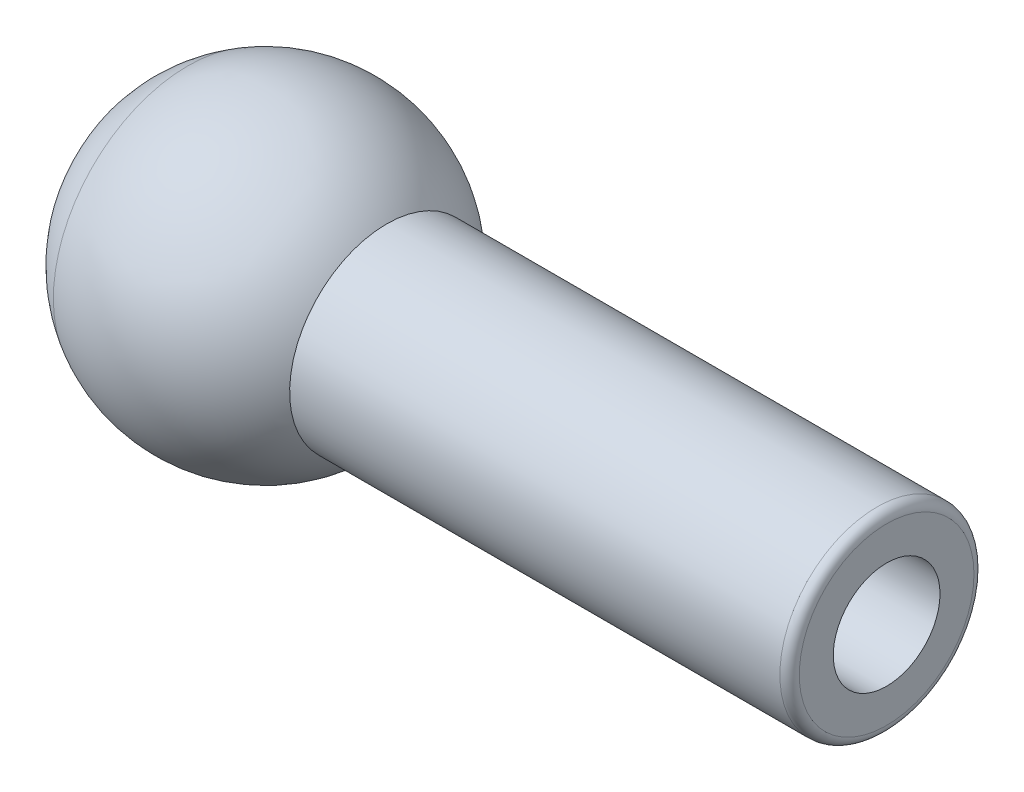
ISO-10303-21;
HEADER;
FILE_DESCRIPTION(('STEP AP214'),'2;1');
FILE_NAME('part.step','',(''),(''),'','','');
FILE_SCHEMA(('AUTOMOTIVE_DESIGN { 1 0 10303 214 1 1 1 1 }'));
ENDSEC;
DATA;
#1=APPLICATION_CONTEXT('core data for automotive mechanical design processes');
#2=APPLICATION_PROTOCOL_DEFINITION('international standard','automotive_design',2000,#1);
#3=PRODUCT_CONTEXT('',#1,'mechanical');
#4=PRODUCT('Part','Part','',(#3));
#5=PRODUCT_RELATED_PRODUCT_CATEGORY('part','',(#4));
#6=PRODUCT_DEFINITION_FORMATION('','',#4);
#7=PRODUCT_DEFINITION_CONTEXT('part definition',#1,'design');
#8=PRODUCT_DEFINITION('design','',#6,#7);
#9=PRODUCT_DEFINITION_SHAPE('','',#8);
#10=(LENGTH_UNIT() NAMED_UNIT(*) SI_UNIT(.MILLI.,.METRE.));
#11=(NAMED_UNIT(*) PLANE_ANGLE_UNIT() SI_UNIT($,.RADIAN.));
#12=(NAMED_UNIT(*) SI_UNIT($,.STERADIAN.) SOLID_ANGLE_UNIT());
#13=UNCERTAINTY_MEASURE_WITH_UNIT(LENGTH_MEASURE(1.E-05),#10,'distance_accuracy_value','');
#14=(GEOMETRIC_REPRESENTATION_CONTEXT(3) GLOBAL_UNCERTAINTY_ASSIGNED_CONTEXT((#13)) GLOBAL_UNIT_ASSIGNED_CONTEXT((#10,
#11,#12)) REPRESENTATION_CONTEXT('',''));
#15=CARTESIAN_POINT('',(0.,0.,0.));
#16=DIRECTION('',(0.,0.,1.));
#17=DIRECTION('',(1.,0.,0.));
#18=AXIS2_PLACEMENT_3D('',#15,#16,#17);
#19=CARTESIAN_POINT('',(-3.175,0.,0.));
#20=DIRECTION('',(1.,0.,0.));
#21=DIRECTION('',(0.,0.,-1.));
#22=AXIS2_PLACEMENT_3D('',#19,#20,#21);
#23=PLANE('',#22);
#24=CARTESIAN_POINT('',(-3.175,0.,0.));
#25=DIRECTION('',(1.,0.,0.));
#26=DIRECTION('',(0.,0.,-1.));
#27=AXIS2_PLACEMENT_3D('',#24,#25,#26);
#28=CIRCLE('',#27,3.96875);
#29=CARTESIAN_POINT('',(-3.175,0.,-3.96875));
#30=VERTEX_POINT('',#29);
#31=EDGE_CURVE('E378',#30,#30,#28,.T.);
#32=ORIENTED_EDGE('',*,*,#31,.F.);
#33=EDGE_LOOP('',(#32));
#34=FACE_BOUND('',#33,.T.);
#35=CARTESIAN_POINT('',(-3.175,0.,0.));
#36=DIRECTION('',(1.,0.,0.));
#37=DIRECTION('',(0.,0.,-1.));
#38=AXIS2_PLACEMENT_3D('',#35,#36,#37);
#39=CIRCLE('',#38,5.49926131403119);
#40=CARTESIAN_POINT('',(-3.175,5.49926131403119,0.));
#41=VERTEX_POINT('',#40);
#42=EDGE_CURVE('E374',#41,#41,#39,.F.);
#43=ORIENTED_EDGE('',*,*,#42,.F.);
#44=EDGE_LOOP('',(#43));
#45=FACE_BOUND('',#44,.T.);
#46=ADVANCED_FACE('F370',(#34,#45),#23,.T.);
#47=CARTESIAN_POINT('',(0.,0.,0.));
#48=DIRECTION('',(1.,0.,0.));
#49=DIRECTION('',(0.,0.,-1.));
#50=AXIS2_PLACEMENT_3D('',#47,#48,#49);
#51=CYLINDRICAL_SURFACE('',#50,3.96875);
#52=CARTESIAN_POINT('',(-4.95696716122873,0.,0.));
#53=DIRECTION('',(1.,0.,0.));
#54=DIRECTION('',(0.,0.,-1.));
#55=AXIS2_PLACEMENT_3D('',#52,#53,#54);
#56=CIRCLE('',#55,3.96875);
#57=CARTESIAN_POINT('',(-4.95696716122873,3.96875,0.));
#58=VERTEX_POINT('',#57);
#59=EDGE_CURVE('E12',#58,#58,#56,.T.);
#60=ORIENTED_EDGE('',*,*,#59,.F.);
#61=EDGE_LOOP('',(#60));
#62=FACE_BOUND('',#61,.T.);
#63=ORIENTED_EDGE('',*,*,#31,.T.);
#64=EDGE_LOOP('',(#63));
#65=FACE_BOUND('',#64,.T.);
#66=ADVANCED_FACE('F372',(#62,#65),#51,.F.);
#67=CARTESIAN_POINT('',(0.,0.,0.));
#68=DIRECTION('',(1.,0.,0.));
#69=DIRECTION('',(0.,1.,0.));
#70=AXIS2_PLACEMENT_3D('',#67,#68,#69);
#71=SPHERICAL_SURFACE('',#70,6.35);
#72=CARTESIAN_POINT('',(-4.95696716122873,3.96875,0.));
#73=CARTESIAN_POINT('',(-4.94158553108122,3.9879616610096,0.));
#74=CARTESIAN_POINT('',(-4.92609220280035,4.00708389176063,0.));
#75=CARTESIAN_POINT('',(-4.89488426806199,4.04514692701055,0.));
#76=CARTESIAN_POINT('',(-4.8791696616045,4.06408773150945,0.));
#77=CARTESIAN_POINT('',(-4.84752128860298,4.10178534852015,0.));
#78=CARTESIAN_POINT('',(-4.83158752205895,4.12054216103195,0.));
#79=CARTESIAN_POINT('',(-4.79950298461745,4.15786925977867,0.));
#80=CARTESIAN_POINT('',(-4.78335221372,4.1764395460136,0.));
#81=CARTESIAN_POINT('',(-4.75083585049322,4.21339108137181,0.));
#82=CARTESIAN_POINT('',(-4.73447025816391,4.2317723304951,0.));
#83=CARTESIAN_POINT('',(-4.70152646461155,4.26834330682248,0.));
#84=CARTESIAN_POINT('',(-4.68494826338851,4.28653303402658,0.));
#85=CARTESIAN_POINT('',(-4.65158149317462,4.3227185074729,0.));
#86=CARTESIAN_POINT('',(-4.63479292418377,4.34071425371512,0.));
#87=CARTESIAN_POINT('',(-4.60100768804047,4.37650933245259,0.));
#88=CARTESIAN_POINT('',(-4.58401102088802,4.39430866494783,0.));
#89=CARTESIAN_POINT('',(-4.54981188614888,4.42970850994978,0.));
#90=CARTESIAN_POINT('',(-4.53260941856219,4.44730902245647,0.));
#91=CARTESIAN_POINT('',(-4.49800100850641,4.48230884812007,0.));
#92=CARTESIAN_POINT('',(-4.48059506603732,4.49970816127697,0.));
#93=CARTESIAN_POINT('',(-4.44558205927501,4.53430323607863,0.));
#94=CARTESIAN_POINT('',(-4.42797499498177,4.55149899772339,0.));
#95=CARTESIAN_POINT('',(-4.39256212481869,4.58568464485611,0.));
#96=CARTESIAN_POINT('',(-4.37475631894883,4.60267453034407,0.));
#97=CARTESIAN_POINT('',(-4.33894837274726,4.63644612835032,0.));
#98=CARTESIAN_POINT('',(-4.32094623241554,4.65322784086861,0.));
#99=CARTESIAN_POINT('',(-4.2847480509469,4.68658082426491,0.));
#100=CARTESIAN_POINT('',(-4.26655200980997,4.70315209514292,0.));
#101=CARTESIAN_POINT('',(-4.22996848660045,4.73608195503708,0.));
#102=CARTESIAN_POINT('',(-4.21158100452786,4.75244054405322,0.));
#103=CARTESIAN_POINT('',(-4.17461708519687,4.78494282875388,0.));
#104=CARTESIAN_POINT('',(-4.15604064793847,4.80108652443839,0.));
#105=CARTESIAN_POINT('',(-4.11870132953006,4.83315684005682,0.));
#106=CARTESIAN_POINT('',(-4.09993844838005,4.84908345999074,0.));
#107=CARTESIAN_POINT('',(-4.06222877868737,4.88071747103486,0.));
#108=CARTESIAN_POINT('',(-4.0432819901447,4.89642486214506,0.));
#109=CARTESIAN_POINT('',(-4.00520706702761,4.92761829210551,0.));
#110=CARTESIAN_POINT('',(-3.98607893245318,4.94310433095577,0.));
#111=CARTESIAN_POINT('',(-3.94764390314907,4.97385296288408,0.));
#112=CARTESIAN_POINT('',(-3.92833700841939,4.98911555596214,0.));
#113=CARTESIAN_POINT('',(-3.88954706884736,5.01941523304076,0.));
#114=CARTESIAN_POINT('',(-3.87006402400501,5.03445231704133,0.));
#115=CARTESIAN_POINT('',(-3.83092441806346,5.06429894314564,0.));
#116=CARTESIAN_POINT('',(-3.81126785696424,5.07910848524937,0.));
#117=CARTESIAN_POINT('',(-3.77178387582188,5.1084980255013,0.));
#118=CARTESIAN_POINT('',(-3.75195645577873,5.1230780236495,0.));
#119=CARTESIAN_POINT('',(-3.71213343715948,5.15200650496328,0.));
#120=CARTESIAN_POINT('',(-3.69213783858337,5.16635498812886,0.));
#121=CARTESIAN_POINT('',(-3.65198116604424,5.19481849974728,0.));
#122=CARTESIAN_POINT('',(-3.6318200920812,5.20893352820012,0.));
#123=CARTESIAN_POINT('',(-3.59133519428632,5.23692822222627,0.));
#124=CARTESIAN_POINT('',(-3.57101137045447,5.25080788779958,0.));
#125=CARTESIAN_POINT('',(-3.53020372043444,5.27832997970561,0.));
#126=CARTESIAN_POINT('',(-3.50971989424626,5.29197240603833,0.));
#127=CARTESIAN_POINT('',(-3.46859500868357,5.31901817521974,0.));
#128=CARTESIAN_POINT('',(-3.44795394930906,5.33242151806843,0.));
#129=CARTESIAN_POINT('',(-3.40651738769789,5.35898730818783,0.));
#130=CARTESIAN_POINT('',(-3.38572188546122,5.37214975545854,0.));
#131=CARTESIAN_POINT('',(-3.34397924970817,5.3982319755341,0.));
#132=CARTESIAN_POINT('',(-3.32303211619177,5.41115174833895,0.));
#133=CARTESIAN_POINT('',(-3.28098904854373,5.43674687101243,0.));
#134=CARTESIAN_POINT('',(-3.25989311441208,5.44942222088107,0.));
#135=CARTESIAN_POINT('',(-3.2175553016005,5.47452679117021,0.));
#136=CARTESIAN_POINT('',(-3.19631342292057,5.48695601159071,0.));
#137=CARTESIAN_POINT('',(-3.175,5.49926131403119,0.));
#138=B_SPLINE_CURVE_WITH_KNOTS('',3,(#72,#73,#74,#75,#76,#77,#78,#79,#80,#81,#82,#83,#84,#85,
#86,#87,#88,#89,#90,#91,#92,#93,#94,#95,#96,#97,#98,#99,#100,#101,#102,#103,#104,#105,#106,#107,
#108,#109,#110,#111,#112,#113,#114,#115,#116,#117,#118,#119,#120,#121,#122,#123,#124,#125,#126,
#127,#128,#129,#130,#131,#132,#133,#134,#135,#136,#137),.UNSPECIFIED.,.F.,.F.,(4,2,2,2,2,2,2,2,
2,2,2,2,2,2,2,2,2,2,2,2,2,2,2,2,2,2,2,2,2,2,2,2,4),(0.,0.0738314346147441,0.147662869229488,
0.221494303844233,0.295325738458978,0.369157173073723,0.442988607688467,0.516820042303212,
0.590651476917956,0.664482911532701,0.738314346147445,0.812145780762189,0.885977215376934,
0.959808649991679,1.03364008460642,1.10747151922117,1.18130295383591,1.25513438845066,
1.3289658230654,1.40279725768015,1.47662869229489,1.55046012690963,1.62429156152438,
1.69812299613912,1.77195443075387,1.84578586536861,1.91961729998336,1.9934487345981,
2.06728016921285,2.14111160382759,2.21494303844233,2.28877447305708,2.36260590767182),.UNSPECIFIED.);
#139=EDGE_CURVE('BSEAM388',#58,#41,#138,.T.);
#140=ORIENTED_EDGE('',*,*,#59,.T.);
#141=ORIENTED_EDGE('',*,*,#42,.T.);
#142=ORIENTED_EDGE('',*,*,#139,.T.);
#143=ORIENTED_EDGE('',*,*,#139,.F.);
#144=EDGE_LOOP('',(#140,#142,#141,#143));
#145=FACE_BOUND('',#144,.T.);
#146=ADVANCED_FACE('F388',(#145),#71,.T.);
#147=CLOSED_SHELL('',(#46,#66,#146));
#148=MANIFOLD_SOLID_BREP('B2',#147);
#149=CARTESIAN_POINT('',(-3.175,0.,0.));
#150=DIRECTION('',(1.,0.,0.));
#151=DIRECTION('',(0.,0.,-1.));
#152=AXIS2_PLACEMENT_3D('',#149,#150,#151);
#153=PLANE('',#152);
#154=CARTESIAN_POINT('',(-3.175,0.,0.));
#155=DIRECTION('',(1.,0.,0.));
#156=DIRECTION('',(0.,0.,-1.));
#157=AXIS2_PLACEMENT_3D('',#154,#155,#156);
#158=CIRCLE('',#157,5.49926131403119);
#159=CARTESIAN_POINT('',(-3.175,5.49926131403119,0.));
#160=VERTEX_POINT('',#159);
#161=EDGE_CURVE('E417',#160,#160,#158,.F.);
#162=ORIENTED_EDGE('',*,*,#161,.T.);
#163=EDGE_LOOP('',(#162));
#164=FACE_BOUND('',#163,.T.);
#165=CARTESIAN_POINT('',(-3.175,0.,0.));
#166=DIRECTION('',(1.,0.,0.));
#167=DIRECTION('',(0.,0.,-1.));
#168=AXIS2_PLACEMENT_3D('',#165,#166,#167);
#169=CIRCLE('',#168,3.96875);
#170=CARTESIAN_POINT('',(-3.175,0.,-3.96875));
#171=VERTEX_POINT('',#170);
#172=EDGE_CURVE('E369',#171,#171,#169,.T.);
#173=ORIENTED_EDGE('',*,*,#172,.T.);
#174=EDGE_LOOP('',(#173));
#175=FACE_BOUND('',#174,.T.);
#176=ADVANCED_FACE('F410',(#164,#175),#153,.F.);
#177=CARTESIAN_POINT('',(0.,0.,0.));
#178=DIRECTION('',(1.,0.,0.));
#179=DIRECTION('',(0.,0.,-1.));
#180=AXIS2_PLACEMENT_3D('',#177,#178,#179);
#181=CYLINDRICAL_SURFACE('',#180,2.1828125);
#182=CARTESIAN_POINT('',(25.4,0.,0.));
#183=DIRECTION('',(1.,0.,0.));
#184=DIRECTION('',(0.,0.,-1.));
#185=AXIS2_PLACEMENT_3D('',#182,#183,#184);
#186=CIRCLE('',#185,2.1828125);
#187=CARTESIAN_POINT('',(25.4,0.,-2.1828125));
#188=VERTEX_POINT('',#187);
#189=EDGE_CURVE('E437',#188,#188,#186,.T.);
#190=ORIENTED_EDGE('',*,*,#189,.T.);
#191=EDGE_LOOP('',(#190));
#192=FACE_BOUND('',#191,.T.);
#193=CARTESIAN_POINT('',(0.254000000000001,0.,0.));
#194=DIRECTION('',(1.,0.,0.));
#195=DIRECTION('',(0.,0.,-1.));
#196=AXIS2_PLACEMENT_3D('',#193,#194,#195);
#197=CIRCLE('',#196,2.1828125);
#198=CARTESIAN_POINT('',(0.254000000000001,0.,-2.1828125));
#199=VERTEX_POINT('',#198);
#200=EDGE_CURVE('E428',#199,#199,#197,.T.);
#201=ORIENTED_EDGE('',*,*,#200,.F.);
#202=EDGE_LOOP('',(#201));
#203=FACE_BOUND('',#202,.T.);
#204=ADVANCED_FACE('F412',(#192,#203),#181,.F.);
#205=CARTESIAN_POINT('',(25.4,3.96875,0.));
#206=DIRECTION('',(1.,0.,0.));
#207=DIRECTION('',(0.,0.,-1.));
#208=AXIS2_PLACEMENT_3D('',#205,#206,#207);
#209=PLANE('',#208);
#210=CARTESIAN_POINT('',(25.4,0.,0.));
#211=DIRECTION('',(1.,0.,0.));
#212=DIRECTION('',(0.,0.,-1.));
#213=AXIS2_PLACEMENT_3D('',#210,#211,#212);
#214=CIRCLE('',#213,3.571875);
#215=CARTESIAN_POINT('',(25.4,0.,-3.571875));
#216=VERTEX_POINT('',#215);
#217=EDGE_CURVE('E426',#216,#216,#214,.T.);
#218=ORIENTED_EDGE('',*,*,#217,.T.);
#219=EDGE_LOOP('',(#218));
#220=FACE_BOUND('',#219,.T.);
#221=ORIENTED_EDGE('',*,*,#189,.F.);
#222=EDGE_LOOP('',(#221));
#223=FACE_BOUND('',#222,.T.);
#224=ADVANCED_FACE('F443',(#220,#223),#209,.T.);
#225=CARTESIAN_POINT('',(0.,0.,0.));
#226=DIRECTION('',(1.,0.,0.));
#227=DIRECTION('',(0.,0.,-1.));
#228=AXIS2_PLACEMENT_3D('',#225,#226,#227);
#229=CYLINDRICAL_SURFACE('',#228,3.96875);
#230=CARTESIAN_POINT('',(25.003125,0.,0.));
#231=DIRECTION('',(1.,0.,0.));
#232=DIRECTION('',(0.,0.,-1.));
#233=AXIS2_PLACEMENT_3D('',#230,#231,#232);
#234=CIRCLE('',#233,3.96875);
#235=CARTESIAN_POINT('',(25.003125,0.,-3.96875));
#236=VERTEX_POINT('',#235);
#237=EDGE_CURVE('E421',#236,#236,#234,.F.);
#238=ORIENTED_EDGE('',*,*,#237,.T.);
#239=EDGE_LOOP('',(#238));
#240=FACE_BOUND('',#239,.T.);
#241=CARTESIAN_POINT('',(4.95696716122873,0.,0.));
#242=DIRECTION('',(1.,0.,0.));
#243=DIRECTION('',(0.,0.,-1.));
#244=AXIS2_PLACEMENT_3D('',#241,#242,#243);
#245=CIRCLE('',#244,3.96875);
#246=CARTESIAN_POINT('',(4.95696716122873,3.96875,0.));
#247=VERTEX_POINT('',#246);
#248=EDGE_CURVE('E434',#247,#247,#245,.T.);
#249=ORIENTED_EDGE('',*,*,#248,.T.);
#250=EDGE_LOOP('',(#249));
#251=FACE_BOUND('',#250,.T.);
#252=ADVANCED_FACE('F470',(#240,#251),#229,.T.);
#253=CARTESIAN_POINT('',(0.,0.,0.));
#254=DIRECTION('',(1.,0.,0.));
#255=DIRECTION('',(0.,1.,0.));
#256=AXIS2_PLACEMENT_3D('',#253,#254,#255);
#257=SPHERICAL_SURFACE('',#256,6.35);
#258=CARTESIAN_POINT('',(-3.175,5.49926131403119,0.));
#259=CARTESIAN_POINT('',(-3.09369962527934,5.54620180375616,0.));
#260=CARTESIAN_POINT('',(-3.01135698228311,5.59133680599584,0.));
#261=CARTESIAN_POINT('',(-2.84475208689356,5.67791279501606,0.));
#262=CARTESIAN_POINT('',(-2.76048983450026,5.71935378179659,0.));
#263=CARTESIAN_POINT('',(-2.59021064747066,5.79845869940991,0.));
#264=CARTESIAN_POINT('',(-2.50419371283437,5.83612263024271,0.));
#265=CARTESIAN_POINT('',(-2.33057455116699,5.9075997708278,0.));
#266=CARTESIAN_POINT('',(-2.2429723241359,5.9414129805801,0.));
#267=CARTESIAN_POINT('',(-2.06635481437803,6.0051220657531,0.));
#268=CARTESIAN_POINT('',(-1.97733953165124,6.03501794117379,0.));
#269=CARTESIAN_POINT('',(-1.79807099899702,6.09083358872176,0.));
#270=CARTESIAN_POINT('',(-1.70781774906959,6.11675336084902,0.));
#271=CARTESIAN_POINT('',(-1.52625078585207,6.16456581550291,0.));
#272=CARTESIAN_POINT('',(-1.434937072562,6.18645849802954,0.));
#273=CARTESIAN_POINT('',(-1.25142877736611,6.22617371759419,0.));
#274=CARTESIAN_POINT('',(-1.15923419546029,6.24399625463222,0.));
#275=CARTESIAN_POINT('',(-0.974145488854031,6.27553612970845,0.));
#276=CARTESIAN_POINT('',(-0.88125136415359,6.28925346774665,0.));
#277=CARTESIAN_POINT('',(-0.694946273997775,6.31255596604047,0.));
#278=CARTESIAN_POINT('',(-0.6015353085424,6.32214112629608,0.));
#279=CARTESIAN_POINT('',(-0.414380255326221,6.33716041711814,0.));
#280=CARTESIAN_POINT('',(-0.320636167565416,6.34259454768458,0.));
#281=CARTESIAN_POINT('',(-0.132999243391807,6.34930109142015,0.));
#282=CARTESIAN_POINT('',(-0.039106406979003,6.35057350458928,0.));
#283=CARTESIAN_POINT('',(0.148643348297054,6.34895411097527,0.));
#284=CARTESIAN_POINT('',(0.242500267160308,6.34606230419213,0.));
#285=CARTESIAN_POINT('',(0.429993591775572,6.33612015821132,0.));
#286=CARTESIAN_POINT('',(0.523629997527581,6.32906981901366,0.));
#287=CARTESIAN_POINT('',(0.710498134059134,6.31082447464348,0.));
#288=CARTESIAN_POINT('',(0.803729864838677,6.29962946947096,0.));
#289=CARTESIAN_POINT('',(0.989605285469073,6.27311681122169,0.));
#290=CARTESIAN_POINT('',(1.08224897531993,6.25779915814494,0.));
#291=CARTESIAN_POINT('',(1.2667661046817,6.22307133048385,0.));
#292=CARTESIAN_POINT('',(1.35863954419262,6.20366115589952,0.));
#293=CARTESIAN_POINT('',(1.54143547837337,6.16078646069415,0.));
#294=CARTESIAN_POINT('',(1.63235797304322,6.13732194007312,0.));
#295=CARTESIAN_POINT('',(1.81307319333637,6.08638470225678,0.));
#296=CARTESIAN_POINT('',(1.90286591895968,6.05891198506148,0.));
#297=CARTESIAN_POINT('',(2.08114499895752,6.00001238678515,0.));
#298=CARTESIAN_POINT('',(2.16963135333204,5.96858550570412,0.));
#299=CARTESIAN_POINT('',(2.34512365796916,5.90183938929988,0.));
#300=CARTESIAN_POINT('',(2.43212960823176,5.86652015397666,0.));
#301=CARTESIAN_POINT('',(2.60448998340874,5.79205879412431,0.));
#302=CARTESIAN_POINT('',(2.68984440832312,5.75291666959517,0.));
#303=CARTESIAN_POINT('',(2.85873385973648,5.67088651512474,0.));
#304=CARTESIAN_POINT('',(2.94226888623546,5.62799848518345,0.));
#305=CARTESIAN_POINT('',(3.10735524614435,5.53856087107879,0.));
#306=CARTESIAN_POINT('',(3.18890657955425,5.49201128691543,0.));
#307=CARTESIAN_POINT('',(3.34986515992815,5.3953421168713,0.));
#308=CARTESIAN_POINT('',(3.42927240689214,5.34522253099054,0.));
#309=CARTESIAN_POINT('',(3.58578663856647,5.24151193194605,0.));
#310=CARTESIAN_POINT('',(3.66289362327681,5.18792091878233,0.));
#311=CARTESIAN_POINT('',(3.81465567645809,5.07737286513025,0.));
#312=CARTESIAN_POINT('',(3.88931074492903,5.0204158246419,0.));
#313=CARTESIAN_POINT('',(4.03602214252255,4.9032477439742,0.));
#314=CARTESIAN_POINT('',(4.10807847164511,4.84303670379484,0.));
#315=CARTESIAN_POINT('',(4.24945064682681,4.71947902345465,0.));
#316=CARTESIAN_POINT('',(4.31876649288595,4.65613238329383,0.));
#317=CARTESIAN_POINT('',(4.45452146661656,4.52642817352518,0.));
#318=CARTESIAN_POINT('',(4.52096059428802,4.46007060391737,0.));
#319=CARTESIAN_POINT('',(4.65083111163056,4.32447474022215,0.));
#320=CARTESIAN_POINT('',(4.71426250130164,4.25523644613475,0.));
#321=CARTESIAN_POINT('',(4.83799408870445,4.11401644995372,0.));
#322=CARTESIAN_POINT('',(4.89829428643617,4.04203474786009,0.));
#323=CARTESIAN_POINT('',(4.95696716122873,3.96875,0.));
#324=B_SPLINE_CURVE_WITH_KNOTS('',3,(#258,#259,#260,#261,#262,#263,#264,#265,#266,#267,#268,
#269,#270,#271,#272,#273,#274,#275,#276,#277,#278,#279,#280,#281,#282,#283,#284,#285,#286,#287,
#288,#289,#290,#291,#292,#293,#294,#295,#296,#297,#298,#299,#300,#301,#302,#303,#304,#305,#306,
#307,#308,#309,#310,#311,#312,#313,#314,#315,#316,#317,#318,#319,#320,#321,#322,#323),
.UNSPECIFIED.,.F.,.F.,(4,2,2,2,2,2,2,2,2,2,2,2,2,2,2,2,2,2,2,2,2,2,2,2,2,2,2,2,2,2,2,2,4),(0.,
0.281612031628599,0.563224063257198,0.844836094885797,1.1264481265144,1.408060158143,
1.6896721897716,1.97128422140019,2.25289625302879,2.53450828465739,2.81612031628599,
3.09773234791459,3.37934437954319,3.66095641117179,3.94256844280039,4.22418047442899,
4.50579250605759,4.78740453768618,5.06901656931478,5.35062860094338,5.63224063257198,
5.91385266420058,6.19546469582918,6.47707672745778,6.75868875908638,7.04030079071498,
7.32191282234358,7.60352485397218,7.88513688560078,8.16674891722938,8.44836094885797,
8.72997298048657,9.01158501211517),.UNSPECIFIED.);
#325=EDGE_CURVE('BSEAM478',#160,#247,#324,.T.);
#326=ORIENTED_EDGE('',*,*,#161,.F.);
#327=ORIENTED_EDGE('',*,*,#248,.F.);
#328=ORIENTED_EDGE('',*,*,#325,.T.);
#329=ORIENTED_EDGE('',*,*,#325,.F.);
#330=EDGE_LOOP('',(#326,#328,#327,#329));
#331=FACE_BOUND('',#330,.T.);
#332=ADVANCED_FACE('F478',(#331),#257,.T.);
#333=CARTESIAN_POINT('',(0.,0.,0.));
#334=DIRECTION('',(1.,0.,0.));
#335=DIRECTION('',(0.,0.,-1.));
#336=AXIS2_PLACEMENT_3D('',#333,#334,#335);
#337=CYLINDRICAL_SURFACE('',#336,3.96875);
#338=ORIENTED_EDGE('',*,*,#172,.F.);
#339=EDGE_LOOP('',(#338));
#340=FACE_BOUND('',#339,.T.);
#341=CARTESIAN_POINT('',(0.254000000000001,0.,0.));
#342=DIRECTION('',(1.,0.,0.));
#343=DIRECTION('',(0.,0.,-1.));
#344=AXIS2_PLACEMENT_3D('',#341,#342,#343);
#345=CIRCLE('',#344,3.96875);
#346=CARTESIAN_POINT('',(0.254000000000001,0.,-3.96875));
#347=VERTEX_POINT('',#346);
#348=EDGE_CURVE('E431',#347,#347,#345,.T.);
#349=ORIENTED_EDGE('',*,*,#348,.T.);
#350=EDGE_LOOP('',(#349));
#351=FACE_BOUND('',#350,.T.);
#352=ADVANCED_FACE('F456',(#340,#351),#337,.F.);
#353=CARTESIAN_POINT('',(0.254000000000001,2.1828125,0.));
#354=DIRECTION('',(-1.,0.,0.));
#355=DIRECTION('',(0.,0.,1.));
#356=AXIS2_PLACEMENT_3D('',#353,#354,#355);
#357=PLANE('',#356);
#358=ORIENTED_EDGE('',*,*,#200,.T.);
#359=EDGE_LOOP('',(#358));
#360=FACE_BOUND('',#359,.T.);
#361=ORIENTED_EDGE('',*,*,#348,.F.);
#362=EDGE_LOOP('',(#361));
#363=FACE_BOUND('',#362,.T.);
#364=ADVANCED_FACE('F448',(#360,#363),#357,.T.);
#365=CARTESIAN_POINT('',(25.003125,0.,0.));
#366=DIRECTION('',(1.,0.,0.));
#367=DIRECTION('',(0.,0.,-1.));
#368=AXIS2_PLACEMENT_3D('',#365,#366,#367);
#369=TOROIDAL_SURFACE('',#368,3.571875,0.396875);
#370=ORIENTED_EDGE('',*,*,#237,.F.);
#371=EDGE_LOOP('',(#370));
#372=FACE_BOUND('',#371,.T.);
#373=ORIENTED_EDGE('',*,*,#217,.F.);
#374=EDGE_LOOP('',(#373));
#375=FACE_BOUND('',#374,.T.);
#376=ADVANCED_FACE('F446',(#372,#375),#369,.T.);
#377=CLOSED_SHELL('',(#176,#204,#224,#252,#332,#352,#364,#376));
#378=MANIFOLD_SOLID_BREP('B7',#377);
#379=ADVANCED_BREP_SHAPE_REPRESENTATION('',(#18,#148,#378),#14);
#380=SHAPE_DEFINITION_REPRESENTATION(#9,#379);
ENDSEC;
END-ISO-10303-21;
